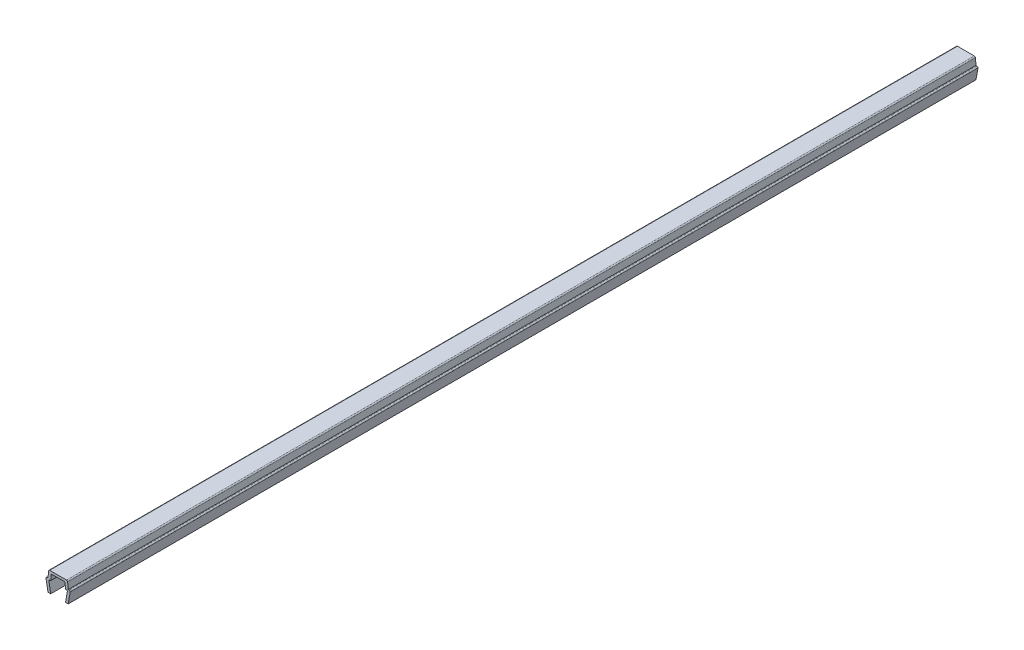
ISO-10303-21;
HEADER;
FILE_DESCRIPTION(('STEP AP214'),'2;1');
FILE_NAME('part.step','',(''),(''),'','','');
FILE_SCHEMA(('AUTOMOTIVE_DESIGN { 1 0 10303 214 1 1 1 1 }'));
ENDSEC;
DATA;
#1=APPLICATION_CONTEXT('core data for automotive mechanical design processes');
#2=APPLICATION_PROTOCOL_DEFINITION('international standard','automotive_design',2000,#1);
#3=PRODUCT_CONTEXT('',#1,'mechanical');
#4=PRODUCT('Part','Part','',(#3));
#5=PRODUCT_RELATED_PRODUCT_CATEGORY('part','',(#4));
#6=PRODUCT_DEFINITION_FORMATION('','',#4);
#7=PRODUCT_DEFINITION_CONTEXT('part definition',#1,'design');
#8=PRODUCT_DEFINITION('design','',#6,#7);
#9=PRODUCT_DEFINITION_SHAPE('','',#8);
#10=(LENGTH_UNIT() NAMED_UNIT(*) SI_UNIT(.MILLI.,.METRE.));
#11=(NAMED_UNIT(*) PLANE_ANGLE_UNIT() SI_UNIT($,.RADIAN.));
#12=(NAMED_UNIT(*) SI_UNIT($,.STERADIAN.) SOLID_ANGLE_UNIT());
#13=UNCERTAINTY_MEASURE_WITH_UNIT(LENGTH_MEASURE(1.E-05),#10,'distance_accuracy_value','');
#14=(GEOMETRIC_REPRESENTATION_CONTEXT(3) GLOBAL_UNCERTAINTY_ASSIGNED_CONTEXT((#13)) GLOBAL_UNIT_ASSIGNED_CONTEXT((#10,
#11,#12)) REPRESENTATION_CONTEXT('',''));
#15=CARTESIAN_POINT('',(0.,0.,0.));
#16=DIRECTION('',(0.,0.,1.));
#17=DIRECTION('',(1.,0.,0.));
#18=AXIS2_PLACEMENT_3D('',#15,#16,#17);
#19=CARTESIAN_POINT('',(-3.25000000000003,3.35000000000003,135.));
#20=DIRECTION('',(0.,0.,-1.));
#21=DIRECTION('',(-1.,0.,0.));
#22=AXIS2_PLACEMENT_3D('',#19,#20,#21);
#23=CYLINDRICAL_SURFACE('',#22,0.349999999999972);
#24=DIRECTION('',(0.,0.,-1.));
#25=VECTOR('',#24,1.);
#26=CARTESIAN_POINT('',(-3.25,3.7,135.));
#27=LINE('',#26,#25);
#28=CARTESIAN_POINT('',(-3.25,3.7,135.));
#29=VERTEX_POINT('',#28);
#30=CARTESIAN_POINT('',(-3.25,3.7,-135.));
#31=VERTEX_POINT('',#30);
#32=EDGE_CURVE('E211',#29,#31,#27,.T.);
#33=ORIENTED_EDGE('',*,*,#32,.T.);
#34=CARTESIAN_POINT('',(-3.25000000000003,3.35000000000003,-135.));
#35=DIRECTION('',(0.,0.,1.));
#36=DIRECTION('',(1.,0.,0.));
#37=AXIS2_PLACEMENT_3D('',#34,#35,#36);
#38=CIRCLE('',#37,0.349999999999972);
#39=CARTESIAN_POINT('',(-3.6,3.35,-135.));
#40=VERTEX_POINT('',#39);
#41=EDGE_CURVE('E205',#31,#40,#38,.T.);
#42=ORIENTED_EDGE('',*,*,#41,.T.);
#43=DIRECTION('',(0.,0.,-1.));
#44=VECTOR('',#43,1.);
#45=CARTESIAN_POINT('',(-3.6,3.35,135.));
#46=LINE('',#45,#44);
#47=CARTESIAN_POINT('',(-3.6,3.35,135.));
#48=VERTEX_POINT('',#47);
#49=EDGE_CURVE('E11',#48,#40,#46,.T.);
#50=ORIENTED_EDGE('',*,*,#49,.F.);
#51=CARTESIAN_POINT('',(-3.25000000000003,3.35000000000003,135.));
#52=DIRECTION('',(0.,0.,1.));
#53=DIRECTION('',(1.,0.,0.));
#54=AXIS2_PLACEMENT_3D('',#51,#52,#53);
#55=CIRCLE('',#54,0.349999999999972);
#56=EDGE_CURVE('E277',#29,#48,#55,.T.);
#57=ORIENTED_EDGE('',*,*,#56,.F.);
#58=EDGE_LOOP('',(#33,#42,#50,#57));
#59=FACE_BOUND('',#58,.T.);
#60=ADVANCED_FACE('F33',(#59),#23,.T.);
#61=CARTESIAN_POINT('',(-3.6,3.35,135.));
#62=DIRECTION('',(0.984336643247304,0.176299100283099,0.));
#63=DIRECTION('',(-0.176299100283099,0.984336643247304,0.));
#64=AXIS2_PLACEMENT_3D('',#61,#62,#63);
#65=PLANE('',#64);
#66=ORIENTED_EDGE('',*,*,#49,.T.);
#67=DIRECTION('',(0.176299100283099,-0.984336643247304,0.));
#68=VECTOR('',#67,1.);
#69=CARTESIAN_POINT('',(-3.6,3.35,-135.));
#70=LINE('',#69,#68);
#71=CARTESIAN_POINT('',(-3.,0.,-135.));
#72=VERTEX_POINT('',#71);
#73=EDGE_CURVE('E195',#40,#72,#70,.T.);
#74=ORIENTED_EDGE('',*,*,#73,.T.);
#75=DIRECTION('',(0.,0.,-1.));
#76=VECTOR('',#75,1.);
#77=CARTESIAN_POINT('',(-3.,0.,135.));
#78=LINE('',#77,#76);
#79=CARTESIAN_POINT('',(-3.,0.,135.));
#80=VERTEX_POINT('',#79);
#81=EDGE_CURVE('E40',#80,#72,#78,.T.);
#82=ORIENTED_EDGE('',*,*,#81,.F.);
#83=DIRECTION('',(0.176299100283099,-0.984336643247304,0.));
#84=VECTOR('',#83,1.);
#85=CARTESIAN_POINT('',(-3.6,3.35,135.));
#86=LINE('',#85,#84);
#87=EDGE_CURVE('E196',#48,#80,#86,.T.);
#88=ORIENTED_EDGE('',*,*,#87,.F.);
#89=EDGE_LOOP('',(#66,#74,#82,#88));
#90=FACE_BOUND('',#89,.T.);
#91=ADVANCED_FACE('F193',(#90),#65,.F.);
#92=CARTESIAN_POINT('',(-3.,0.,135.));
#93=DIRECTION('',(0.,1.,0.));
#94=DIRECTION('',(0.,0.,1.));
#95=AXIS2_PLACEMENT_3D('',#92,#93,#94);
#96=PLANE('',#95);
#97=ORIENTED_EDGE('',*,*,#81,.T.);
#98=DIRECTION('',(1.,0.,0.));
#99=VECTOR('',#98,1.);
#100=CARTESIAN_POINT('',(-3.,0.,-135.));
#101=LINE('',#100,#99);
#102=CARTESIAN_POINT('',(-2.2,0.,-135.));
#103=VERTEX_POINT('',#102);
#104=EDGE_CURVE('E209',#72,#103,#101,.T.);
#105=ORIENTED_EDGE('',*,*,#104,.T.);
#106=DIRECTION('',(0.,0.,-1.));
#107=VECTOR('',#106,1.);
#108=CARTESIAN_POINT('',(-2.2,0.,135.));
#109=LINE('',#108,#107);
#110=CARTESIAN_POINT('',(-2.2,0.,135.));
#111=VERTEX_POINT('',#110);
#112=EDGE_CURVE('E363',#111,#103,#109,.T.);
#113=ORIENTED_EDGE('',*,*,#112,.F.);
#114=DIRECTION('',(1.,0.,0.));
#115=VECTOR('',#114,1.);
#116=CARTESIAN_POINT('',(-3.,0.,135.));
#117=LINE('',#116,#115);
#118=EDGE_CURVE('E280',#80,#111,#117,.T.);
#119=ORIENTED_EDGE('',*,*,#118,.F.);
#120=EDGE_LOOP('',(#97,#105,#113,#119));
#121=FACE_BOUND('',#120,.T.);
#122=ADVANCED_FACE('F366',(#121),#96,.F.);
#123=CARTESIAN_POINT('',(-2.2,0.,135.));
#124=DIRECTION('',(-0.984336643247306,-0.176299100283088,0.));
#125=DIRECTION('',(0.176299100283088,-0.984336643247306,0.));
#126=AXIS2_PLACEMENT_3D('',#123,#124,#125);
#127=PLANE('',#126);
#128=ORIENTED_EDGE('',*,*,#112,.T.);
#129=DIRECTION('',(-0.176299100283088,0.984336643247306,0.));
#130=VECTOR('',#129,1.);
#131=CARTESIAN_POINT('',(-2.2,0.,-135.));
#132=LINE('',#131,#130);
#133=CARTESIAN_POINT('',(-2.7352170713255,2.9882953149009,-135.));
#134=VERTEX_POINT('',#133);
#135=EDGE_CURVE('E215',#103,#134,#132,.T.);
#136=ORIENTED_EDGE('',*,*,#135,.T.);
#137=DIRECTION('',(0.,0.,-1.));
#138=VECTOR('',#137,1.);
#139=CARTESIAN_POINT('',(-2.7352170713255,2.9882953149009,135.));
#140=LINE('',#139,#138);
#141=CARTESIAN_POINT('',(-2.7352170713255,2.9882953149009,135.));
#142=VERTEX_POINT('',#141);
#143=EDGE_CURVE('E361',#142,#134,#140,.T.);
#144=ORIENTED_EDGE('',*,*,#143,.F.);
#145=DIRECTION('',(-0.176299100283088,0.984336643247306,0.));
#146=VECTOR('',#145,1.);
#147=CARTESIAN_POINT('',(-2.2,0.,135.));
#148=LINE('',#147,#146);
#149=EDGE_CURVE('E282',#111,#142,#148,.T.);
#150=ORIENTED_EDGE('',*,*,#149,.F.);
#151=EDGE_LOOP('',(#128,#136,#144,#150));
#152=FACE_BOUND('',#151,.T.);
#153=ADVANCED_FACE('F374',(#152),#127,.F.);
#154=CARTESIAN_POINT('',(-2.390699246189,3.05000000000004,135.));
#155=DIRECTION('',(0.,0.,-1.));
#156=DIRECTION('',(-1.,0.,0.));
#157=AXIS2_PLACEMENT_3D('',#154,#155,#156);
#158=CYLINDRICAL_SURFACE('',#157,0.349999999999955);
#159=ORIENTED_EDGE('',*,*,#143,.T.);
#160=CARTESIAN_POINT('',(-2.390699246189,3.05000000000004,-135.));
#161=DIRECTION('',(0.,0.,-1.));
#162=DIRECTION('',(-1.,0.,0.));
#163=AXIS2_PLACEMENT_3D('',#160,#161,#162);
#164=CIRCLE('',#163,0.349999999999955);
#165=CARTESIAN_POINT('',(-2.390699246189,3.4,-135.));
#166=VERTEX_POINT('',#165);
#167=EDGE_CURVE('E218',#134,#166,#164,.T.);
#168=ORIENTED_EDGE('',*,*,#167,.T.);
#169=DIRECTION('',(0.,0.,-1.));
#170=VECTOR('',#169,1.);
#171=CARTESIAN_POINT('',(-2.390699246189,3.4,135.));
#172=LINE('',#171,#170);
#173=CARTESIAN_POINT('',(-2.390699246189,3.4,135.));
#174=VERTEX_POINT('',#173);
#175=EDGE_CURVE('E359',#174,#166,#172,.T.);
#176=ORIENTED_EDGE('',*,*,#175,.F.);
#177=CARTESIAN_POINT('',(-2.390699246189,3.05000000000004,135.));
#178=DIRECTION('',(0.,0.,-1.));
#179=DIRECTION('',(-1.,0.,0.));
#180=AXIS2_PLACEMENT_3D('',#177,#178,#179);
#181=CIRCLE('',#180,0.349999999999955);
#182=EDGE_CURVE('E284',#142,#174,#181,.T.);
#183=ORIENTED_EDGE('',*,*,#182,.F.);
#184=EDGE_LOOP('',(#159,#168,#176,#183));
#185=FACE_BOUND('',#184,.T.);
#186=ADVANCED_FACE('F377',(#185),#158,.F.);
#187=CARTESIAN_POINT('',(-2.390699246189,3.4,135.));
#188=DIRECTION('',(0.,1.,0.));
#189=DIRECTION('',(0.,0.,1.));
#190=AXIS2_PLACEMENT_3D('',#187,#188,#189);
#191=PLANE('',#190);
#192=ORIENTED_EDGE('',*,*,#175,.T.);
#193=DIRECTION('',(1.,0.,0.));
#194=VECTOR('',#193,1.);
#195=CARTESIAN_POINT('',(-2.390699246189,3.4,-135.));
#196=LINE('',#195,#194);
#197=CARTESIAN_POINT('',(-2.2,3.4,-135.));
#198=VERTEX_POINT('',#197);
#199=EDGE_CURVE('E221',#166,#198,#196,.T.);
#200=ORIENTED_EDGE('',*,*,#199,.T.);
#201=DIRECTION('',(0.,0.,-1.));
#202=VECTOR('',#201,1.);
#203=CARTESIAN_POINT('',(-2.2,3.4,135.));
#204=LINE('',#203,#202);
#205=CARTESIAN_POINT('',(-2.2,3.4,135.));
#206=VERTEX_POINT('',#205);
#207=EDGE_CURVE('E357',#206,#198,#204,.T.);
#208=ORIENTED_EDGE('',*,*,#207,.F.);
#209=DIRECTION('',(1.,0.,0.));
#210=VECTOR('',#209,1.);
#211=CARTESIAN_POINT('',(-2.390699246189,3.4,135.));
#212=LINE('',#211,#210);
#213=EDGE_CURVE('E286',#174,#206,#212,.T.);
#214=ORIENTED_EDGE('',*,*,#213,.F.);
#215=EDGE_LOOP('',(#192,#200,#208,#214));
#216=FACE_BOUND('',#215,.T.);
#217=ADVANCED_FACE('F382',(#216),#191,.F.);
#218=CARTESIAN_POINT('',(-2.2,3.4,135.));
#219=DIRECTION('',(-0.996194698091743,0.08715574274769,0.));
#220=DIRECTION('',(-0.08715574274769,-0.996194698091743,0.));
#221=AXIS2_PLACEMENT_3D('',#218,#219,#220);
#222=PLANE('',#221);
#223=ORIENTED_EDGE('',*,*,#207,.T.);
#224=DIRECTION('',(0.08715574274769,0.996194698091743,0.));
#225=VECTOR('',#224,1.);
#226=CARTESIAN_POINT('',(-2.2,3.4,-135.));
#227=LINE('',#226,#225);
#228=CARTESIAN_POINT('',(-2.0704726390793,4.8805045099617,-135.));
#229=VERTEX_POINT('',#228);
#230=EDGE_CURVE('E224',#198,#229,#227,.T.);
#231=ORIENTED_EDGE('',*,*,#230,.T.);
#232=DIRECTION('',(0.,0.,-1.));
#233=VECTOR('',#232,1.);
#234=CARTESIAN_POINT('',(-2.0704726390793,4.8805045099617,135.));
#235=LINE('',#234,#233);
#236=CARTESIAN_POINT('',(-2.0704726390793,4.8805045099617,135.));
#237=VERTEX_POINT('',#236);
#238=EDGE_CURVE('E355',#237,#229,#235,.T.);
#239=ORIENTED_EDGE('',*,*,#238,.F.);
#240=DIRECTION('',(0.08715574274769,0.996194698091743,0.));
#241=VECTOR('',#240,1.);
#242=CARTESIAN_POINT('',(-2.2,3.4,135.));
#243=LINE('',#242,#241);
#244=EDGE_CURVE('E288',#206,#237,#243,.T.);
#245=ORIENTED_EDGE('',*,*,#244,.F.);
#246=EDGE_LOOP('',(#223,#231,#239,#245));
#247=FACE_BOUND('',#246,.T.);
#248=ADVANCED_FACE('F388',(#247),#222,.F.);
#249=CARTESIAN_POINT('',(-1.72180449474716,4.84999999999996,135.));
#250=DIRECTION('',(0.,0.,-1.));
#251=DIRECTION('',(-1.,0.,0.));
#252=AXIS2_PLACEMENT_3D('',#249,#250,#251);
#253=CYLINDRICAL_SURFACE('',#252,0.350000000000036);
#254=ORIENTED_EDGE('',*,*,#238,.T.);
#255=CARTESIAN_POINT('',(-1.72180449474716,4.84999999999996,-135.));
#256=DIRECTION('',(0.,0.,-1.));
#257=DIRECTION('',(-1.,0.,0.));
#258=AXIS2_PLACEMENT_3D('',#255,#256,#257);
#259=CIRCLE('',#258,0.350000000000036);
#260=CARTESIAN_POINT('',(-1.7218044947472,5.2,-135.));
#261=VERTEX_POINT('',#260);
#262=EDGE_CURVE('E227',#229,#261,#259,.T.);
#263=ORIENTED_EDGE('',*,*,#262,.T.);
#264=DIRECTION('',(0.,0.,-1.));
#265=VECTOR('',#264,1.);
#266=CARTESIAN_POINT('',(-1.7218044947472,5.2,135.));
#267=LINE('',#266,#265);
#268=CARTESIAN_POINT('',(-1.7218044947472,5.2,135.));
#269=VERTEX_POINT('',#268);
#270=EDGE_CURVE('E353',#269,#261,#267,.T.);
#271=ORIENTED_EDGE('',*,*,#270,.F.);
#272=CARTESIAN_POINT('',(-1.72180449474716,4.84999999999996,135.));
#273=DIRECTION('',(0.,0.,-1.));
#274=DIRECTION('',(-1.,0.,0.));
#275=AXIS2_PLACEMENT_3D('',#272,#273,#274);
#276=CIRCLE('',#275,0.350000000000036);
#277=EDGE_CURVE('E290',#237,#269,#276,.T.);
#278=ORIENTED_EDGE('',*,*,#277,.F.);
#279=EDGE_LOOP('',(#254,#263,#271,#278));
#280=FACE_BOUND('',#279,.T.);
#281=ADVANCED_FACE('F392',(#280),#253,.F.);
#282=CARTESIAN_POINT('',(-1.7218044947472,5.2,135.));
#283=DIRECTION('',(0.,1.,0.));
#284=DIRECTION('',(0.,0.,1.));
#285=AXIS2_PLACEMENT_3D('',#282,#283,#284);
#286=PLANE('',#285);
#287=ORIENTED_EDGE('',*,*,#270,.T.);
#288=DIRECTION('',(1.,0.,0.));
#289=VECTOR('',#288,1.);
#290=CARTESIAN_POINT('',(-1.7218044947472,5.2,-135.));
#291=LINE('',#290,#289);
#292=CARTESIAN_POINT('',(1.7218044947472,5.2,-135.));
#293=VERTEX_POINT('',#292);
#294=EDGE_CURVE('E230',#261,#293,#291,.T.);
#295=ORIENTED_EDGE('',*,*,#294,.T.);
#296=DIRECTION('',(0.,0.,-1.));
#297=VECTOR('',#296,1.);
#298=CARTESIAN_POINT('',(1.7218044947472,5.2,135.));
#299=LINE('',#298,#297);
#300=CARTESIAN_POINT('',(1.7218044947472,5.2,135.));
#301=VERTEX_POINT('',#300);
#302=EDGE_CURVE('E351',#301,#293,#299,.T.);
#303=ORIENTED_EDGE('',*,*,#302,.F.);
#304=DIRECTION('',(1.,0.,0.));
#305=VECTOR('',#304,1.);
#306=CARTESIAN_POINT('',(-1.7218044947472,5.2,135.));
#307=LINE('',#306,#305);
#308=EDGE_CURVE('E292',#269,#301,#307,.T.);
#309=ORIENTED_EDGE('',*,*,#308,.F.);
#310=EDGE_LOOP('',(#287,#295,#303,#309));
#311=FACE_BOUND('',#310,.T.);
#312=ADVANCED_FACE('F397',(#311),#286,.F.);
#313=CARTESIAN_POINT('',(1.72180449474716,4.84999999999996,135.));
#314=DIRECTION('',(0.,0.,-1.));
#315=DIRECTION('',(-1.,0.,0.));
#316=AXIS2_PLACEMENT_3D('',#313,#314,#315);
#317=CYLINDRICAL_SURFACE('',#316,0.350000000000036);
#318=ORIENTED_EDGE('',*,*,#302,.T.);
#319=CARTESIAN_POINT('',(1.72180449474716,4.84999999999996,-135.));
#320=DIRECTION('',(0.,0.,-1.));
#321=DIRECTION('',(-1.,0.,0.));
#322=AXIS2_PLACEMENT_3D('',#319,#320,#321);
#323=CIRCLE('',#322,0.350000000000036);
#324=CARTESIAN_POINT('',(2.0704726390793,4.8805045099617,-135.));
#325=VERTEX_POINT('',#324);
#326=EDGE_CURVE('E233',#293,#325,#323,.T.);
#327=ORIENTED_EDGE('',*,*,#326,.T.);
#328=DIRECTION('',(0.,0.,-1.));
#329=VECTOR('',#328,1.);
#330=CARTESIAN_POINT('',(2.0704726390793,4.8805045099617,135.));
#331=LINE('',#330,#329);
#332=CARTESIAN_POINT('',(2.0704726390793,4.8805045099617,135.));
#333=VERTEX_POINT('',#332);
#334=EDGE_CURVE('E349',#333,#325,#331,.T.);
#335=ORIENTED_EDGE('',*,*,#334,.F.);
#336=CARTESIAN_POINT('',(1.72180449474716,4.84999999999996,135.));
#337=DIRECTION('',(0.,0.,-1.));
#338=DIRECTION('',(-1.,0.,0.));
#339=AXIS2_PLACEMENT_3D('',#336,#337,#338);
#340=CIRCLE('',#339,0.350000000000036);
#341=EDGE_CURVE('E294',#301,#333,#340,.T.);
#342=ORIENTED_EDGE('',*,*,#341,.F.);
#343=EDGE_LOOP('',(#318,#327,#335,#342));
#344=FACE_BOUND('',#343,.T.);
#345=ADVANCED_FACE('F403',(#344),#317,.F.);
#346=CARTESIAN_POINT('',(2.0704726390793,4.8805045099617,135.));
#347=DIRECTION('',(0.996194698091743,0.08715574274769,0.));
#348=DIRECTION('',(-0.08715574274769,0.996194698091743,0.));
#349=AXIS2_PLACEMENT_3D('',#346,#347,#348);
#350=PLANE('',#349);
#351=ORIENTED_EDGE('',*,*,#334,.T.);
#352=DIRECTION('',(0.08715574274769,-0.996194698091743,0.));
#353=VECTOR('',#352,1.);
#354=CARTESIAN_POINT('',(2.0704726390793,4.8805045099617,-135.));
#355=LINE('',#354,#353);
#356=CARTESIAN_POINT('',(2.2,3.4,-135.));
#357=VERTEX_POINT('',#356);
#358=EDGE_CURVE('E236',#325,#357,#355,.T.);
#359=ORIENTED_EDGE('',*,*,#358,.T.);
#360=DIRECTION('',(0.,0.,-1.));
#361=VECTOR('',#360,1.);
#362=CARTESIAN_POINT('',(2.2,3.4,135.));
#363=LINE('',#362,#361);
#364=CARTESIAN_POINT('',(2.2,3.4,135.));
#365=VERTEX_POINT('',#364);
#366=EDGE_CURVE('E347',#365,#357,#363,.T.);
#367=ORIENTED_EDGE('',*,*,#366,.F.);
#368=DIRECTION('',(0.08715574274769,-0.996194698091743,0.));
#369=VECTOR('',#368,1.);
#370=CARTESIAN_POINT('',(2.0704726390793,4.8805045099617,135.));
#371=LINE('',#370,#369);
#372=EDGE_CURVE('E296',#333,#365,#371,.T.);
#373=ORIENTED_EDGE('',*,*,#372,.F.);
#374=EDGE_LOOP('',(#351,#359,#367,#373));
#375=FACE_BOUND('',#374,.T.);
#376=ADVANCED_FACE('F407',(#375),#350,.F.);
#377=CARTESIAN_POINT('',(2.2,3.4,135.));
#378=DIRECTION('',(0.,1.,0.));
#379=DIRECTION('',(0.,0.,1.));
#380=AXIS2_PLACEMENT_3D('',#377,#378,#379);
#381=PLANE('',#380);
#382=ORIENTED_EDGE('',*,*,#366,.T.);
#383=DIRECTION('',(1.,0.,0.));
#384=VECTOR('',#383,1.);
#385=CARTESIAN_POINT('',(2.2,3.4,-135.));
#386=LINE('',#385,#384);
#387=CARTESIAN_POINT('',(2.390699246189,3.4,-135.));
#388=VERTEX_POINT('',#387);
#389=EDGE_CURVE('E239',#357,#388,#386,.T.);
#390=ORIENTED_EDGE('',*,*,#389,.T.);
#391=DIRECTION('',(0.,0.,-1.));
#392=VECTOR('',#391,1.);
#393=CARTESIAN_POINT('',(2.390699246189,3.4,135.));
#394=LINE('',#393,#392);
#395=CARTESIAN_POINT('',(2.390699246189,3.4,135.));
#396=VERTEX_POINT('',#395);
#397=EDGE_CURVE('E345',#396,#388,#394,.T.);
#398=ORIENTED_EDGE('',*,*,#397,.F.);
#399=DIRECTION('',(1.,0.,0.));
#400=VECTOR('',#399,1.);
#401=CARTESIAN_POINT('',(2.2,3.4,135.));
#402=LINE('',#401,#400);
#403=EDGE_CURVE('E298',#365,#396,#402,.T.);
#404=ORIENTED_EDGE('',*,*,#403,.F.);
#405=EDGE_LOOP('',(#382,#390,#398,#404));
#406=FACE_BOUND('',#405,.T.);
#407=ADVANCED_FACE('F412',(#406),#381,.F.);
#408=CARTESIAN_POINT('',(2.390699246189,3.05000000000004,135.));
#409=DIRECTION('',(0.,0.,-1.));
#410=DIRECTION('',(-1.,0.,0.));
#411=AXIS2_PLACEMENT_3D('',#408,#409,#410);
#412=CYLINDRICAL_SURFACE('',#411,0.349999999999955);
#413=ORIENTED_EDGE('',*,*,#397,.T.);
#414=CARTESIAN_POINT('',(2.390699246189,3.05000000000004,-135.));
#415=DIRECTION('',(0.,0.,-1.));
#416=DIRECTION('',(-1.,0.,0.));
#417=AXIS2_PLACEMENT_3D('',#414,#415,#416);
#418=CIRCLE('',#417,0.349999999999955);
#419=CARTESIAN_POINT('',(2.7352170713255,2.9882953149009,-135.));
#420=VERTEX_POINT('',#419);
#421=EDGE_CURVE('E242',#388,#420,#418,.T.);
#422=ORIENTED_EDGE('',*,*,#421,.T.);
#423=DIRECTION('',(0.,0.,-1.));
#424=VECTOR('',#423,1.);
#425=CARTESIAN_POINT('',(2.7352170713255,2.9882953149009,135.));
#426=LINE('',#425,#424);
#427=CARTESIAN_POINT('',(2.7352170713255,2.9882953149009,135.));
#428=VERTEX_POINT('',#427);
#429=EDGE_CURVE('E343',#428,#420,#426,.T.);
#430=ORIENTED_EDGE('',*,*,#429,.F.);
#431=CARTESIAN_POINT('',(2.390699246189,3.05000000000004,135.));
#432=DIRECTION('',(0.,0.,-1.));
#433=DIRECTION('',(-1.,0.,0.));
#434=AXIS2_PLACEMENT_3D('',#431,#432,#433);
#435=CIRCLE('',#434,0.349999999999955);
#436=EDGE_CURVE('E300',#396,#428,#435,.T.);
#437=ORIENTED_EDGE('',*,*,#436,.F.);
#438=EDGE_LOOP('',(#413,#422,#430,#437));
#439=FACE_BOUND('',#438,.T.);
#440=ADVANCED_FACE('F418',(#439),#412,.F.);
#441=CARTESIAN_POINT('',(2.7352170713255,2.9882953149009,135.));
#442=DIRECTION('',(0.984336643247306,-0.176299100283088,0.));
#443=DIRECTION('',(0.176299100283088,0.984336643247306,0.));
#444=AXIS2_PLACEMENT_3D('',#441,#442,#443);
#445=PLANE('',#444);
#446=ORIENTED_EDGE('',*,*,#429,.T.);
#447=DIRECTION('',(-0.176299100283088,-0.984336643247306,0.));
#448=VECTOR('',#447,1.);
#449=CARTESIAN_POINT('',(2.7352170713255,2.9882953149009,-135.));
#450=LINE('',#449,#448);
#451=CARTESIAN_POINT('',(2.2,0.,-135.));
#452=VERTEX_POINT('',#451);
#453=EDGE_CURVE('E245',#420,#452,#450,.T.);
#454=ORIENTED_EDGE('',*,*,#453,.T.);
#455=DIRECTION('',(0.,0.,-1.));
#456=VECTOR('',#455,1.);
#457=CARTESIAN_POINT('',(2.2,0.,135.));
#458=LINE('',#457,#456);
#459=CARTESIAN_POINT('',(2.2,0.,135.));
#460=VERTEX_POINT('',#459);
#461=EDGE_CURVE('E341',#460,#452,#458,.T.);
#462=ORIENTED_EDGE('',*,*,#461,.F.);
#463=DIRECTION('',(-0.176299100283088,-0.984336643247306,0.));
#464=VECTOR('',#463,1.);
#465=CARTESIAN_POINT('',(2.7352170713255,2.9882953149009,135.));
#466=LINE('',#465,#464);
#467=EDGE_CURVE('E302',#428,#460,#466,.T.);
#468=ORIENTED_EDGE('',*,*,#467,.F.);
#469=EDGE_LOOP('',(#446,#454,#462,#468));
#470=FACE_BOUND('',#469,.T.);
#471=ADVANCED_FACE('F422',(#470),#445,.F.);
#472=CARTESIAN_POINT('',(2.2,0.,135.));
#473=DIRECTION('',(0.,1.,0.));
#474=DIRECTION('',(0.,0.,1.));
#475=AXIS2_PLACEMENT_3D('',#472,#473,#474);
#476=PLANE('',#475);
#477=ORIENTED_EDGE('',*,*,#461,.T.);
#478=DIRECTION('',(1.,0.,0.));
#479=VECTOR('',#478,1.);
#480=CARTESIAN_POINT('',(2.2,0.,-135.));
#481=LINE('',#480,#479);
#482=CARTESIAN_POINT('',(3.,0.,-135.));
#483=VERTEX_POINT('',#482);
#484=EDGE_CURVE('E248',#452,#483,#481,.T.);
#485=ORIENTED_EDGE('',*,*,#484,.T.);
#486=DIRECTION('',(0.,0.,-1.));
#487=VECTOR('',#486,1.);
#488=CARTESIAN_POINT('',(3.,0.,135.));
#489=LINE('',#488,#487);
#490=CARTESIAN_POINT('',(3.,0.,135.));
#491=VERTEX_POINT('',#490);
#492=EDGE_CURVE('E339',#491,#483,#489,.T.);
#493=ORIENTED_EDGE('',*,*,#492,.F.);
#494=DIRECTION('',(1.,0.,0.));
#495=VECTOR('',#494,1.);
#496=CARTESIAN_POINT('',(2.2,0.,135.));
#497=LINE('',#496,#495);
#498=EDGE_CURVE('E304',#460,#491,#497,.T.);
#499=ORIENTED_EDGE('',*,*,#498,.F.);
#500=EDGE_LOOP('',(#477,#485,#493,#499));
#501=FACE_BOUND('',#500,.T.);
#502=ADVANCED_FACE('F427',(#501),#476,.F.);
#503=CARTESIAN_POINT('',(3.,0.,135.));
#504=DIRECTION('',(-0.984336643247304,0.176299100283099,0.));
#505=DIRECTION('',(-0.176299100283099,-0.984336643247304,0.));
#506=AXIS2_PLACEMENT_3D('',#503,#504,#505);
#507=PLANE('',#506);
#508=ORIENTED_EDGE('',*,*,#492,.T.);
#509=DIRECTION('',(0.176299100283099,0.984336643247304,0.));
#510=VECTOR('',#509,1.);
#511=CARTESIAN_POINT('',(3.,0.,-135.));
#512=LINE('',#511,#510);
#513=CARTESIAN_POINT('',(3.6,3.35,-135.));
#514=VERTEX_POINT('',#513);
#515=EDGE_CURVE('E251',#483,#514,#512,.T.);
#516=ORIENTED_EDGE('',*,*,#515,.T.);
#517=DIRECTION('',(0.,0.,-1.));
#518=VECTOR('',#517,1.);
#519=CARTESIAN_POINT('',(3.6,3.35,135.));
#520=LINE('',#519,#518);
#521=CARTESIAN_POINT('',(3.6,3.35,135.));
#522=VERTEX_POINT('',#521);
#523=EDGE_CURVE('E337',#522,#514,#520,.T.);
#524=ORIENTED_EDGE('',*,*,#523,.F.);
#525=DIRECTION('',(0.176299100283099,0.984336643247304,0.));
#526=VECTOR('',#525,1.);
#527=CARTESIAN_POINT('',(3.,0.,135.));
#528=LINE('',#527,#526);
#529=EDGE_CURVE('E306',#491,#522,#528,.T.);
#530=ORIENTED_EDGE('',*,*,#529,.F.);
#531=EDGE_LOOP('',(#508,#516,#524,#530));
#532=FACE_BOUND('',#531,.T.);
#533=ADVANCED_FACE('F433',(#532),#507,.F.);
#534=CARTESIAN_POINT('',(3.25000000000003,3.35000000000003,135.));
#535=DIRECTION('',(0.,0.,-1.));
#536=DIRECTION('',(-1.,0.,0.));
#537=AXIS2_PLACEMENT_3D('',#534,#535,#536);
#538=CYLINDRICAL_SURFACE('',#537,0.349999999999972);
#539=ORIENTED_EDGE('',*,*,#523,.T.);
#540=CARTESIAN_POINT('',(3.25000000000003,3.35000000000003,-135.));
#541=DIRECTION('',(0.,0.,1.));
#542=DIRECTION('',(1.,0.,0.));
#543=AXIS2_PLACEMENT_3D('',#540,#541,#542);
#544=CIRCLE('',#543,0.349999999999972);
#545=CARTESIAN_POINT('',(3.25,3.7,-135.));
#546=VERTEX_POINT('',#545);
#547=EDGE_CURVE('E254',#514,#546,#544,.T.);
#548=ORIENTED_EDGE('',*,*,#547,.T.);
#549=DIRECTION('',(0.,0.,-1.));
#550=VECTOR('',#549,1.);
#551=CARTESIAN_POINT('',(3.25,3.7,135.));
#552=LINE('',#551,#550);
#553=CARTESIAN_POINT('',(3.25,3.7,135.));
#554=VERTEX_POINT('',#553);
#555=EDGE_CURVE('E335',#554,#546,#552,.T.);
#556=ORIENTED_EDGE('',*,*,#555,.F.);
#557=CARTESIAN_POINT('',(3.25000000000003,3.35000000000003,135.));
#558=DIRECTION('',(0.,0.,1.));
#559=DIRECTION('',(1.,0.,0.));
#560=AXIS2_PLACEMENT_3D('',#557,#558,#559);
#561=CIRCLE('',#560,0.349999999999972);
#562=EDGE_CURVE('E308',#522,#554,#561,.T.);
#563=ORIENTED_EDGE('',*,*,#562,.F.);
#564=EDGE_LOOP('',(#539,#548,#556,#563));
#565=FACE_BOUND('',#564,.T.);
#566=ADVANCED_FACE('F437',(#565),#538,.T.);
#567=CARTESIAN_POINT('',(3.25,3.7,135.));
#568=DIRECTION('',(0.,-1.,0.));
#569=DIRECTION('',(0.,0.,-1.));
#570=AXIS2_PLACEMENT_3D('',#567,#568,#569);
#571=PLANE('',#570);
#572=ORIENTED_EDGE('',*,*,#555,.T.);
#573=DIRECTION('',(-1.,0.,0.));
#574=VECTOR('',#573,1.);
#575=CARTESIAN_POINT('',(3.25,3.7,-135.));
#576=LINE('',#575,#574);
#577=CARTESIAN_POINT('',(3.,3.7,-135.));
#578=VERTEX_POINT('',#577);
#579=EDGE_CURVE('E257',#546,#578,#576,.T.);
#580=ORIENTED_EDGE('',*,*,#579,.T.);
#581=DIRECTION('',(0.,0.,-1.));
#582=VECTOR('',#581,1.);
#583=CARTESIAN_POINT('',(3.,3.7,135.));
#584=LINE('',#583,#582);
#585=CARTESIAN_POINT('',(3.,3.7,135.));
#586=VERTEX_POINT('',#585);
#587=EDGE_CURVE('E333',#586,#578,#584,.T.);
#588=ORIENTED_EDGE('',*,*,#587,.F.);
#589=DIRECTION('',(-1.,0.,0.));
#590=VECTOR('',#589,1.);
#591=CARTESIAN_POINT('',(3.25,3.7,135.));
#592=LINE('',#591,#590);
#593=EDGE_CURVE('E310',#554,#586,#592,.T.);
#594=ORIENTED_EDGE('',*,*,#593,.F.);
#595=EDGE_LOOP('',(#572,#580,#588,#594));
#596=FACE_BOUND('',#595,.T.);
#597=ADVANCED_FACE('F442',(#596),#571,.F.);
#598=CARTESIAN_POINT('',(3.,3.7,135.));
#599=DIRECTION('',(-0.996194698091746,-0.0871557427476467,0.));
#600=DIRECTION('',(0.0871557427476467,-0.996194698091747,0.));
#601=AXIS2_PLACEMENT_3D('',#598,#599,#600);
#602=PLANE('',#601);
#603=ORIENTED_EDGE('',*,*,#587,.T.);
#604=DIRECTION('',(-0.0871557427476467,0.996194698091747,0.));
#605=VECTOR('',#604,1.);
#606=CARTESIAN_POINT('',(3.,3.7,-135.));
#607=LINE('',#606,#605);
#608=CARTESIAN_POINT('',(2.835477173669,5.5805045099617,-135.));
#609=VERTEX_POINT('',#608);
#610=EDGE_CURVE('E260',#578,#609,#607,.T.);
#611=ORIENTED_EDGE('',*,*,#610,.T.);
#612=DIRECTION('',(0.,0.,-1.));
#613=VECTOR('',#612,1.);
#614=CARTESIAN_POINT('',(2.835477173669,5.5805045099617,135.));
#615=LINE('',#614,#613);
#616=CARTESIAN_POINT('',(2.835477173669,5.5805045099617,135.));
#617=VERTEX_POINT('',#616);
#618=EDGE_CURVE('E331',#617,#609,#615,.T.);
#619=ORIENTED_EDGE('',*,*,#618,.F.);
#620=DIRECTION('',(-0.0871557427476467,0.996194698091747,0.));
#621=VECTOR('',#620,1.);
#622=CARTESIAN_POINT('',(3.,3.7,135.));
#623=LINE('',#622,#621);
#624=EDGE_CURVE('E312',#586,#617,#623,.T.);
#625=ORIENTED_EDGE('',*,*,#624,.F.);
#626=EDGE_LOOP('',(#603,#611,#619,#625));
#627=FACE_BOUND('',#626,.T.);
#628=ADVANCED_FACE('F448',(#627),#602,.F.);
#629=CARTESIAN_POINT('',(2.48680902933686,5.54999999999996,135.));
#630=DIRECTION('',(0.,0.,-1.));
#631=DIRECTION('',(-1.,0.,0.));
#632=AXIS2_PLACEMENT_3D('',#629,#630,#631);
#633=CYLINDRICAL_SURFACE('',#632,0.350000000000036);
#634=ORIENTED_EDGE('',*,*,#618,.T.);
#635=CARTESIAN_POINT('',(2.48680902933686,5.54999999999996,-135.));
#636=DIRECTION('',(0.,0.,1.));
#637=DIRECTION('',(1.,0.,0.));
#638=AXIS2_PLACEMENT_3D('',#635,#636,#637);
#639=CIRCLE('',#638,0.350000000000036);
#640=CARTESIAN_POINT('',(2.4868090293369,5.9,-135.));
#641=VERTEX_POINT('',#640);
#642=EDGE_CURVE('E263',#609,#641,#639,.T.);
#643=ORIENTED_EDGE('',*,*,#642,.T.);
#644=DIRECTION('',(0.,0.,-1.));
#645=VECTOR('',#644,1.);
#646=CARTESIAN_POINT('',(2.4868090293369,5.9,135.));
#647=LINE('',#646,#645);
#648=CARTESIAN_POINT('',(2.4868090293369,5.9,135.));
#649=VERTEX_POINT('',#648);
#650=EDGE_CURVE('E329',#649,#641,#647,.T.);
#651=ORIENTED_EDGE('',*,*,#650,.F.);
#652=CARTESIAN_POINT('',(2.48680902933686,5.54999999999996,135.));
#653=DIRECTION('',(0.,0.,1.));
#654=DIRECTION('',(1.,0.,0.));
#655=AXIS2_PLACEMENT_3D('',#652,#653,#654);
#656=CIRCLE('',#655,0.350000000000036);
#657=EDGE_CURVE('E314',#617,#649,#656,.T.);
#658=ORIENTED_EDGE('',*,*,#657,.F.);
#659=EDGE_LOOP('',(#634,#643,#651,#658));
#660=FACE_BOUND('',#659,.T.);
#661=ADVANCED_FACE('F452',(#660),#633,.T.);
#662=CARTESIAN_POINT('',(2.4868090293369,5.9,135.));
#663=DIRECTION('',(0.,-1.,0.));
#664=DIRECTION('',(0.,0.,-1.));
#665=AXIS2_PLACEMENT_3D('',#662,#663,#664);
#666=PLANE('',#665);
#667=ORIENTED_EDGE('',*,*,#650,.T.);
#668=DIRECTION('',(-1.,0.,0.));
#669=VECTOR('',#668,1.);
#670=CARTESIAN_POINT('',(2.4868090293369,5.9,-135.));
#671=LINE('',#670,#669);
#672=CARTESIAN_POINT('',(-2.4868090293369,5.9,-135.));
#673=VERTEX_POINT('',#672);
#674=EDGE_CURVE('E266',#641,#673,#671,.T.);
#675=ORIENTED_EDGE('',*,*,#674,.T.);
#676=DIRECTION('',(0.,0.,-1.));
#677=VECTOR('',#676,1.);
#678=CARTESIAN_POINT('',(-2.4868090293369,5.9,135.));
#679=LINE('',#678,#677);
#680=CARTESIAN_POINT('',(-2.4868090293369,5.9,135.));
#681=VERTEX_POINT('',#680);
#682=EDGE_CURVE('E327',#681,#673,#679,.T.);
#683=ORIENTED_EDGE('',*,*,#682,.F.);
#684=DIRECTION('',(-1.,0.,0.));
#685=VECTOR('',#684,1.);
#686=CARTESIAN_POINT('',(2.4868090293369,5.9,135.));
#687=LINE('',#686,#685);
#688=EDGE_CURVE('E316',#649,#681,#687,.T.);
#689=ORIENTED_EDGE('',*,*,#688,.F.);
#690=EDGE_LOOP('',(#667,#675,#683,#689));
#691=FACE_BOUND('',#690,.T.);
#692=ADVANCED_FACE('F457',(#691),#666,.F.);
#693=CARTESIAN_POINT('',(-2.48680902933686,5.54999999999996,135.));
#694=DIRECTION('',(0.,0.,-1.));
#695=DIRECTION('',(-1.,0.,0.));
#696=AXIS2_PLACEMENT_3D('',#693,#694,#695);
#697=CYLINDRICAL_SURFACE('',#696,0.350000000000036);
#698=ORIENTED_EDGE('',*,*,#682,.T.);
#699=CARTESIAN_POINT('',(-2.48680902933686,5.54999999999996,-135.));
#700=DIRECTION('',(0.,0.,1.));
#701=DIRECTION('',(1.,0.,0.));
#702=AXIS2_PLACEMENT_3D('',#699,#700,#701);
#703=CIRCLE('',#702,0.350000000000036);
#704=CARTESIAN_POINT('',(-2.835477173669,5.5805045099617,-135.));
#705=VERTEX_POINT('',#704);
#706=EDGE_CURVE('E269',#673,#705,#703,.T.);
#707=ORIENTED_EDGE('',*,*,#706,.T.);
#708=DIRECTION('',(0.,0.,-1.));
#709=VECTOR('',#708,1.);
#710=CARTESIAN_POINT('',(-2.835477173669,5.5805045099617,135.));
#711=LINE('',#710,#709);
#712=CARTESIAN_POINT('',(-2.835477173669,5.5805045099617,135.));
#713=VERTEX_POINT('',#712);
#714=EDGE_CURVE('E325',#713,#705,#711,.T.);
#715=ORIENTED_EDGE('',*,*,#714,.F.);
#716=CARTESIAN_POINT('',(-2.48680902933686,5.54999999999996,135.));
#717=DIRECTION('',(0.,0.,1.));
#718=DIRECTION('',(1.,0.,0.));
#719=AXIS2_PLACEMENT_3D('',#716,#717,#718);
#720=CIRCLE('',#719,0.350000000000036);
#721=EDGE_CURVE('E318',#681,#713,#720,.T.);
#722=ORIENTED_EDGE('',*,*,#721,.F.);
#723=EDGE_LOOP('',(#698,#707,#715,#722));
#724=FACE_BOUND('',#723,.T.);
#725=ADVANCED_FACE('F461',(#724),#697,.T.);
#726=CARTESIAN_POINT('',(-2.835477173669,5.5805045099617,135.));
#727=DIRECTION('',(0.996194698091746,-0.0871557427476467,0.));
#728=DIRECTION('',(0.0871557427476467,0.996194698091747,0.));
#729=AXIS2_PLACEMENT_3D('',#726,#727,#728);
#730=PLANE('',#729);
#731=ORIENTED_EDGE('',*,*,#714,.T.);
#732=DIRECTION('',(-0.0871557427476467,-0.996194698091747,0.));
#733=VECTOR('',#732,1.);
#734=CARTESIAN_POINT('',(-2.835477173669,5.5805045099617,-135.));
#735=LINE('',#734,#733);
#736=CARTESIAN_POINT('',(-3.,3.7,-135.));
#737=VERTEX_POINT('',#736);
#738=EDGE_CURVE('E272',#705,#737,#735,.T.);
#739=ORIENTED_EDGE('',*,*,#738,.T.);
#740=DIRECTION('',(0.,0.,-1.));
#741=VECTOR('',#740,1.);
#742=CARTESIAN_POINT('',(-3.,3.7,135.));
#743=LINE('',#742,#741);
#744=CARTESIAN_POINT('',(-3.,3.7,135.));
#745=VERTEX_POINT('',#744);
#746=EDGE_CURVE('E323',#745,#737,#743,.T.);
#747=ORIENTED_EDGE('',*,*,#746,.F.);
#748=DIRECTION('',(-0.0871557427476467,-0.996194698091747,0.));
#749=VECTOR('',#748,1.);
#750=CARTESIAN_POINT('',(-2.835477173669,5.5805045099617,135.));
#751=LINE('',#750,#749);
#752=EDGE_CURVE('E52',#713,#745,#751,.T.);
#753=ORIENTED_EDGE('',*,*,#752,.F.);
#754=EDGE_LOOP('',(#731,#739,#747,#753));
#755=FACE_BOUND('',#754,.T.);
#756=ADVANCED_FACE('F465',(#755),#730,.F.);
#757=CARTESIAN_POINT('',(-3.,3.7,135.));
#758=DIRECTION('',(0.,-1.,0.));
#759=DIRECTION('',(0.,0.,-1.));
#760=AXIS2_PLACEMENT_3D('',#757,#758,#759);
#761=PLANE('',#760);
#762=ORIENTED_EDGE('',*,*,#746,.T.);
#763=DIRECTION('',(-1.,0.,0.));
#764=VECTOR('',#763,1.);
#765=CARTESIAN_POINT('',(-3.,3.7,-135.));
#766=LINE('',#765,#764);
#767=EDGE_CURVE('E275',#737,#31,#766,.T.);
#768=ORIENTED_EDGE('',*,*,#767,.T.);
#769=ORIENTED_EDGE('',*,*,#32,.F.);
#770=DIRECTION('',(-1.,0.,0.));
#771=VECTOR('',#770,1.);
#772=CARTESIAN_POINT('',(-3.,3.7,135.));
#773=LINE('',#772,#771);
#774=EDGE_CURVE('E47',#745,#29,#773,.T.);
#775=ORIENTED_EDGE('',*,*,#774,.F.);
#776=EDGE_LOOP('',(#762,#768,#769,#775));
#777=FACE_BOUND('',#776,.T.);
#778=ADVANCED_FACE('F467',(#777),#761,.F.);
#779=CARTESIAN_POINT('',(-3.25000000000003,3.35000000000003,135.));
#780=DIRECTION('',(0.,0.,1.));
#781=DIRECTION('',(1.,0.,0.));
#782=AXIS2_PLACEMENT_3D('',#779,#780,#781);
#783=PLANE('',#782);
#784=ORIENTED_EDGE('',*,*,#56,.T.);
#785=ORIENTED_EDGE('',*,*,#87,.T.);
#786=ORIENTED_EDGE('',*,*,#118,.T.);
#787=ORIENTED_EDGE('',*,*,#149,.T.);
#788=ORIENTED_EDGE('',*,*,#182,.T.);
#789=ORIENTED_EDGE('',*,*,#213,.T.);
#790=ORIENTED_EDGE('',*,*,#244,.T.);
#791=ORIENTED_EDGE('',*,*,#277,.T.);
#792=ORIENTED_EDGE('',*,*,#308,.T.);
#793=ORIENTED_EDGE('',*,*,#341,.T.);
#794=ORIENTED_EDGE('',*,*,#372,.T.);
#795=ORIENTED_EDGE('',*,*,#403,.T.);
#796=ORIENTED_EDGE('',*,*,#436,.T.);
#797=ORIENTED_EDGE('',*,*,#467,.T.);
#798=ORIENTED_EDGE('',*,*,#498,.T.);
#799=ORIENTED_EDGE('',*,*,#529,.T.);
#800=ORIENTED_EDGE('',*,*,#562,.T.);
#801=ORIENTED_EDGE('',*,*,#593,.T.);
#802=ORIENTED_EDGE('',*,*,#624,.T.);
#803=ORIENTED_EDGE('',*,*,#657,.T.);
#804=ORIENTED_EDGE('',*,*,#688,.T.);
#805=ORIENTED_EDGE('',*,*,#721,.T.);
#806=ORIENTED_EDGE('',*,*,#752,.T.);
#807=ORIENTED_EDGE('',*,*,#774,.T.);
#808=EDGE_LOOP('',(#784,#785,#786,#787,#788,#789,#790,#791,#792,#793,#794,#795,#796,#797,#798,
#799,#800,#801,#802,#803,#804,#805,#806,#807));
#809=FACE_BOUND('',#808,.T.);
#810=ADVANCED_FACE('F369',(#809),#783,.T.);
#811=CARTESIAN_POINT('',(-3.25000000000003,3.35000000000003,-135.));
#812=DIRECTION('',(0.,0.,1.));
#813=DIRECTION('',(1.,0.,0.));
#814=AXIS2_PLACEMENT_3D('',#811,#812,#813);
#815=PLANE('',#814);
#816=ORIENTED_EDGE('',*,*,#41,.F.);
#817=ORIENTED_EDGE('',*,*,#767,.F.);
#818=ORIENTED_EDGE('',*,*,#738,.F.);
#819=ORIENTED_EDGE('',*,*,#706,.F.);
#820=ORIENTED_EDGE('',*,*,#674,.F.);
#821=ORIENTED_EDGE('',*,*,#642,.F.);
#822=ORIENTED_EDGE('',*,*,#610,.F.);
#823=ORIENTED_EDGE('',*,*,#579,.F.);
#824=ORIENTED_EDGE('',*,*,#547,.F.);
#825=ORIENTED_EDGE('',*,*,#515,.F.);
#826=ORIENTED_EDGE('',*,*,#484,.F.);
#827=ORIENTED_EDGE('',*,*,#453,.F.);
#828=ORIENTED_EDGE('',*,*,#421,.F.);
#829=ORIENTED_EDGE('',*,*,#389,.F.);
#830=ORIENTED_EDGE('',*,*,#358,.F.);
#831=ORIENTED_EDGE('',*,*,#326,.F.);
#832=ORIENTED_EDGE('',*,*,#294,.F.);
#833=ORIENTED_EDGE('',*,*,#262,.F.);
#834=ORIENTED_EDGE('',*,*,#230,.F.);
#835=ORIENTED_EDGE('',*,*,#199,.F.);
#836=ORIENTED_EDGE('',*,*,#167,.F.);
#837=ORIENTED_EDGE('',*,*,#135,.F.);
#838=ORIENTED_EDGE('',*,*,#104,.F.);
#839=ORIENTED_EDGE('',*,*,#73,.F.);
#840=EDGE_LOOP('',(#816,#817,#818,#819,#820,#821,#822,#823,#824,#825,#826,#827,#828,#829,#830,
#831,#832,#833,#834,#835,#836,#837,#838,#839));
#841=FACE_BOUND('',#840,.T.);
#842=ADVANCED_FACE('F203',(#841),#815,.F.);
#843=CLOSED_SHELL('',(#60,#91,#122,#153,#186,#217,#248,#281,#312,#345,#376,#407,#440,#471,#502,
#533,#566,#597,#628,#661,#692,#725,#756,#778,#810,#842));
#844=MANIFOLD_SOLID_BREP('B2',#843);
#845=ADVANCED_BREP_SHAPE_REPRESENTATION('',(#18,#844),#14);
#846=SHAPE_DEFINITION_REPRESENTATION(#9,#845);
ENDSEC;
END-ISO-10303-21;
